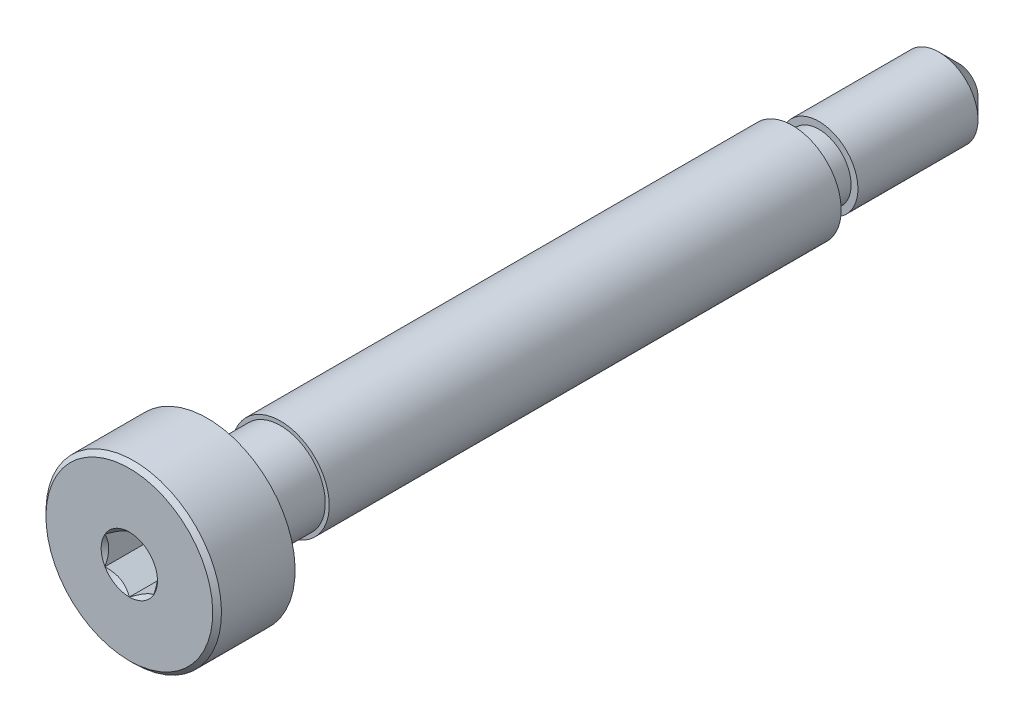
ISO-10303-21;
HEADER;
FILE_DESCRIPTION(('STEP AP214'),'2;1');
FILE_NAME('part.step','',(''),(''),'','','');
FILE_SCHEMA(('AUTOMOTIVE_DESIGN { 1 0 10303 214 1 1 1 1 }'));
ENDSEC;
DATA;
#1=APPLICATION_CONTEXT('core data for automotive mechanical design processes');
#2=APPLICATION_PROTOCOL_DEFINITION('international standard','automotive_design',2000,#1);
#3=PRODUCT_CONTEXT('',#1,'mechanical');
#4=PRODUCT('Part','Part','',(#3));
#5=PRODUCT_RELATED_PRODUCT_CATEGORY('part','',(#4));
#6=PRODUCT_DEFINITION_FORMATION('','',#4);
#7=PRODUCT_DEFINITION_CONTEXT('part definition',#1,'design');
#8=PRODUCT_DEFINITION('design','',#6,#7);
#9=PRODUCT_DEFINITION_SHAPE('','',#8);
#10=(LENGTH_UNIT() NAMED_UNIT(*) SI_UNIT(.MILLI.,.METRE.));
#11=(NAMED_UNIT(*) PLANE_ANGLE_UNIT() SI_UNIT($,.RADIAN.));
#12=(NAMED_UNIT(*) SI_UNIT($,.STERADIAN.) SOLID_ANGLE_UNIT());
#13=UNCERTAINTY_MEASURE_WITH_UNIT(LENGTH_MEASURE(1.E-05),#10,'distance_accuracy_value','');
#14=(GEOMETRIC_REPRESENTATION_CONTEXT(3) GLOBAL_UNCERTAINTY_ASSIGNED_CONTEXT((#13)) GLOBAL_UNIT_ASSIGNED_CONTEXT((#10,
#11,#12)) REPRESENTATION_CONTEXT('',''));
#15=CARTESIAN_POINT('',(0.,0.,0.));
#16=DIRECTION('',(0.,0.,1.));
#17=DIRECTION('',(1.,0.,0.));
#18=AXIS2_PLACEMENT_3D('',#15,#16,#17);
#19=CARTESIAN_POINT('',(0.,0.,21.267));
#20=DIRECTION('',(0.,0.,1.));
#21=DIRECTION('',(0.,-1.,0.));
#22=AXIS2_PLACEMENT_3D('',#19,#20,#21);
#23=CYLINDRICAL_SURFACE('',#22,4.5);
#24=CARTESIAN_POINT('',(0.,0.,17.267));
#25=DIRECTION('',(0.,0.,1.));
#26=DIRECTION('',(0.,-1.,0.));
#27=AXIS2_PLACEMENT_3D('',#24,#25,#26);
#28=CIRCLE('',#27,4.5);
#29=CARTESIAN_POINT('',(0.,-4.5,17.267));
#30=VERTEX_POINT('',#29);
#31=EDGE_CURVE('E195',#30,#30,#28,.T.);
#32=ORIENTED_EDGE('',*,*,#31,.T.);
#33=EDGE_LOOP('',(#32));
#34=FACE_BOUND('',#33,.T.);
#35=CARTESIAN_POINT('',(0.,0.,21.042));
#36=DIRECTION('',(0.,0.,1.));
#37=DIRECTION('',(0.,-1.,0.));
#38=AXIS2_PLACEMENT_3D('',#35,#36,#37);
#39=CIRCLE('',#38,4.5);
#40=CARTESIAN_POINT('',(0.,-4.49999999999999,21.042));
#41=VERTEX_POINT('',#40);
#42=EDGE_CURVE('E455',#41,#41,#39,.T.);
#43=ORIENTED_EDGE('',*,*,#42,.F.);
#44=EDGE_LOOP('',(#43));
#45=FACE_BOUND('',#44,.T.);
#46=ADVANCED_FACE('F49',(#34,#45),#23,.T.);
#47=CARTESIAN_POINT('',(0.,2.5,-12.733));
#48=DIRECTION('',(0.,0.,1.));
#49=DIRECTION('',(0.,-1.,0.));
#50=AXIS2_PLACEMENT_3D('',#47,#48,#49);
#51=PLANE('',#50);
#52=CARTESIAN_POINT('',(0.,0.,-12.733));
#53=DIRECTION('',(0.,0.,1.));
#54=DIRECTION('',(0.,-1.,0.));
#55=AXIS2_PLACEMENT_3D('',#52,#53,#54);
#56=CIRCLE('',#55,1.825397);
#57=CARTESIAN_POINT('',(0.,-1.825397,-12.733));
#58=VERTEX_POINT('',#57);
#59=EDGE_CURVE('E159',#58,#58,#56,.T.);
#60=ORIENTED_EDGE('',*,*,#59,.T.);
#61=EDGE_LOOP('',(#60));
#62=FACE_BOUND('',#61,.T.);
#63=CARTESIAN_POINT('',(0.,0.,-12.733));
#64=DIRECTION('',(0.,0.,1.));
#65=DIRECTION('',(0.,-1.,0.));
#66=AXIS2_PLACEMENT_3D('',#63,#64,#65);
#67=CIRCLE('',#66,2.);
#68=CARTESIAN_POINT('',(0.,-2.,-12.733));
#69=VERTEX_POINT('',#68);
#70=EDGE_CURVE('E186',#69,#69,#67,.T.);
#71=ORIENTED_EDGE('',*,*,#70,.F.);
#72=EDGE_LOOP('',(#71));
#73=FACE_BOUND('',#72,.T.);
#74=ADVANCED_FACE('F285',(#62,#73),#51,.F.);
#75=CARTESIAN_POINT('',(0.,2.,-21.267));
#76=DIRECTION('',(0.,0.,1.));
#77=DIRECTION('',(0.,-1.,0.));
#78=AXIS2_PLACEMENT_3D('',#75,#76,#77);
#79=PLANE('',#78);
#80=CARTESIAN_POINT('',(0.,0.,-21.267));
#81=DIRECTION('',(0.,0.,1.));
#82=DIRECTION('',(0.,-1.,0.));
#83=AXIS2_PLACEMENT_3D('',#80,#81,#82);
#84=CIRCLE('',#83,0.981738054499988);
#85=CARTESIAN_POINT('',(0.,-0.981738054499988,-21.267));
#86=VERTEX_POINT('',#85);
#87=EDGE_CURVE('E12',#86,#86,#84,.F.);
#88=ORIENTED_EDGE('',*,*,#87,.T.);
#89=EDGE_LOOP('',(#88));
#90=FACE_BOUND('',#89,.T.);
#91=ADVANCED_FACE('F293',(#90),#79,.F.);
#92=CARTESIAN_POINT('',(0.,0.,21.267));
#93=DIRECTION('',(0.,0.,1.));
#94=DIRECTION('',(0.,-1.,0.));
#95=AXIS2_PLACEMENT_3D('',#92,#93,#94);
#96=CYLINDRICAL_SURFACE('',#95,2.);
#97=CARTESIAN_POINT('',(0.,0.,-20.2487380545));
#98=DIRECTION('',(0.,0.,1.));
#99=DIRECTION('',(0.,-1.,0.));
#100=AXIS2_PLACEMENT_3D('',#97,#98,#99);
#101=CIRCLE('',#100,2.);
#102=CARTESIAN_POINT('',(0.,-2.,-20.2487380545));
#103=VERTEX_POINT('',#102);
#104=EDGE_CURVE('E58',#103,#103,#101,.T.);
#105=ORIENTED_EDGE('',*,*,#104,.T.);
#106=EDGE_LOOP('',(#105));
#107=FACE_BOUND('',#106,.T.);
#108=CARTESIAN_POINT('',(0.,0.,-14.090682594));
#109=DIRECTION('',(0.,0.,1.));
#110=DIRECTION('',(0.,-1.,0.));
#111=AXIS2_PLACEMENT_3D('',#108,#109,#110);
#112=CIRCLE('',#111,2.);
#113=CARTESIAN_POINT('',(0.,-2.,-14.090682594));
#114=VERTEX_POINT('',#113);
#115=EDGE_CURVE('E174',#114,#114,#112,.T.);
#116=ORIENTED_EDGE('',*,*,#115,.F.);
#117=EDGE_LOOP('',(#116));
#118=FACE_BOUND('',#117,.T.);
#119=ADVANCED_FACE('F489',(#107,#118),#96,.T.);
#120=CARTESIAN_POINT('',(0.,1.650794,-14.090682594));
#121=DIRECTION('',(0.,0.,-1.));
#122=DIRECTION('',(0.,1.,0.));
#123=AXIS2_PLACEMENT_3D('',#120,#121,#122);
#124=PLANE('',#123);
#125=CARTESIAN_POINT('',(0.,0.,-14.090682594));
#126=DIRECTION('',(0.,0.,1.));
#127=DIRECTION('',(0.,-1.,0.));
#128=AXIS2_PLACEMENT_3D('',#125,#126,#127);
#129=CIRCLE('',#128,1.650794);
#130=CARTESIAN_POINT('',(0.,-1.650794,-14.090682594));
#131=VERTEX_POINT('',#130);
#132=EDGE_CURVE('E178',#131,#131,#129,.T.);
#133=ORIENTED_EDGE('',*,*,#132,.F.);
#134=EDGE_LOOP('',(#133));
#135=FACE_BOUND('',#134,.T.);
#136=ORIENTED_EDGE('',*,*,#115,.T.);
#137=EDGE_LOOP('',(#136));
#138=FACE_BOUND('',#137,.T.);
#139=ADVANCED_FACE('F332',(#135,#138),#124,.F.);
#140=CARTESIAN_POINT('',(0.,0.,21.267));
#141=DIRECTION('',(0.,0.,1.));
#142=DIRECTION('',(0.,-1.,0.));
#143=AXIS2_PLACEMENT_3D('',#140,#141,#142);
#144=CYLINDRICAL_SURFACE('',#143,1.650794);
#145=CARTESIAN_POINT('',(0.,0.,-12.907603));
#146=DIRECTION('',(0.,0.,1.));
#147=DIRECTION('',(0.,-1.,0.));
#148=AXIS2_PLACEMENT_3D('',#145,#146,#147);
#149=CIRCLE('',#148,1.650794);
#150=CARTESIAN_POINT('',(0.,-1.650794,-12.907603));
#151=VERTEX_POINT('',#150);
#152=EDGE_CURVE('E182',#151,#151,#149,.T.);
#153=ORIENTED_EDGE('',*,*,#152,.F.);
#154=EDGE_LOOP('',(#153));
#155=FACE_BOUND('',#154,.T.);
#156=ORIENTED_EDGE('',*,*,#132,.T.);
#157=EDGE_LOOP('',(#156));
#158=FACE_BOUND('',#157,.T.);
#159=ADVANCED_FACE('F319',(#155,#158),#144,.T.);
#160=CARTESIAN_POINT('',(0.,0.,-12.907603));
#161=DIRECTION('',(0.,0.,1.));
#162=DIRECTION('',(0.,-1.,0.));
#163=AXIS2_PLACEMENT_3D('',#160,#161,#162);
#164=TOROIDAL_SURFACE('',#163,1.825397,0.174603000000002);
#165=ORIENTED_EDGE('',*,*,#59,.F.);
#166=EDGE_LOOP('',(#165));
#167=FACE_BOUND('',#166,.T.);
#168=ORIENTED_EDGE('',*,*,#152,.T.);
#169=EDGE_LOOP('',(#168));
#170=FACE_BOUND('',#169,.T.);
#171=ADVANCED_FACE('F314',(#167,#170),#164,.F.);
#172=CARTESIAN_POINT('',(0.,0.,-12.733));
#173=DIRECTION('',(0.,0.,-1.));
#174=DIRECTION('',(0.,1.,0.));
#175=AXIS2_PLACEMENT_3D('',#172,#173,#174);
#176=CONICAL_SURFACE('',#175,2.,1.55948252383563);
#177=CARTESIAN_POINT('',(0.,0.,-12.7325689533032));
#178=DIRECTION('',(0.,0.,1.));
#179=DIRECTION('',(0.,-1.,0.));
#180=AXIS2_PLACEMENT_3D('',#177,#178,#179);
#181=CIRCLE('',#180,1.96190243841471);
#182=CARTESIAN_POINT('',(0.,-1.96190243841471,-12.7325689533032));
#183=VERTEX_POINT('',#182);
#184=EDGE_CURVE('E199',#183,#183,#181,.T.);
#185=ORIENTED_EDGE('',*,*,#184,.F.);
#186=EDGE_LOOP('',(#185));
#187=FACE_BOUND('',#186,.T.);
#188=ORIENTED_EDGE('',*,*,#70,.T.);
#189=EDGE_LOOP('',(#188));
#190=FACE_BOUND('',#189,.T.);
#191=ADVANCED_FACE('F311',(#187,#190),#176,.T.);
#192=CARTESIAN_POINT('',(0.,0.,13.5174310466968));
#193=DIRECTION('',(0.,0.,-1.));
#194=DIRECTION('',(0.,1.,0.));
#195=AXIS2_PLACEMENT_3D('',#192,#193,#194);
#196=CONICAL_SURFACE('',#195,2.25890243841471,1.55948252383563);
#197=CARTESIAN_POINT('',(0.,0.,13.517));
#198=DIRECTION('',(0.,0.,1.));
#199=DIRECTION('',(0.,-1.,0.));
#200=AXIS2_PLACEMENT_3D('',#197,#198,#199);
#201=CIRCLE('',#200,2.297);
#202=CARTESIAN_POINT('',(0.,-2.297,13.517));
#203=VERTEX_POINT('',#202);
#204=EDGE_CURVE('E194',#203,#203,#201,.T.);
#205=ORIENTED_EDGE('',*,*,#204,.F.);
#206=EDGE_LOOP('',(#205));
#207=FACE_BOUND('',#206,.T.);
#208=CARTESIAN_POINT('',(0.,0.,13.5174310466968));
#209=DIRECTION('',(0.,0.,1.));
#210=DIRECTION('',(0.,-1.,0.));
#211=AXIS2_PLACEMENT_3D('',#208,#209,#210);
#212=CIRCLE('',#211,2.25890243841471);
#213=CARTESIAN_POINT('',(0.,-2.25890243841471,13.5174310466968));
#214=VERTEX_POINT('',#213);
#215=EDGE_CURVE('E200',#214,#214,#212,.T.);
#216=ORIENTED_EDGE('',*,*,#215,.T.);
#217=EDGE_LOOP('',(#216));
#218=FACE_BOUND('',#217,.T.);
#219=ADVANCED_FACE('F307',(#207,#218),#196,.F.);
#220=CARTESIAN_POINT('',(0.,0.,13.5174310466968));
#221=DIRECTION('',(0.,0.,1.));
#222=DIRECTION('',(0.,-1.,0.));
#223=AXIS2_PLACEMENT_3D('',#220,#221,#222);
#224=CONICAL_SURFACE('',#223,2.25890243841471,0.011313802959248);
#225=ORIENTED_EDGE('',*,*,#184,.T.);
#226=EDGE_LOOP('',(#225));
#227=FACE_BOUND('',#226,.T.);
#228=ORIENTED_EDGE('',*,*,#215,.F.);
#229=EDGE_LOOP('',(#228));
#230=FACE_BOUND('',#229,.T.);
#231=ADVANCED_FACE('F304',(#227,#230),#224,.T.);
#232=CARTESIAN_POINT('',(0.,4.5,17.267));
#233=DIRECTION('',(0.,0.,1.));
#234=DIRECTION('',(0.,-1.,0.));
#235=AXIS2_PLACEMENT_3D('',#232,#233,#234);
#236=PLANE('',#235);
#237=ORIENTED_EDGE('',*,*,#31,.F.);
#238=EDGE_LOOP('',(#237));
#239=FACE_BOUND('',#238,.T.);
#240=CARTESIAN_POINT('',(0.,0.,17.267));
#241=DIRECTION('',(0.,0.,1.));
#242=DIRECTION('',(0.,-1.,0.));
#243=AXIS2_PLACEMENT_3D('',#240,#241,#242);
#244=CIRCLE('',#243,2.297);
#245=CARTESIAN_POINT('',(0.,-2.297,17.267));
#246=VERTEX_POINT('',#245);
#247=EDGE_CURVE('E190',#246,#246,#244,.T.);
#248=ORIENTED_EDGE('',*,*,#247,.T.);
#249=EDGE_LOOP('',(#248));
#250=FACE_BOUND('',#249,.T.);
#251=ADVANCED_FACE('F298',(#239,#250),#236,.F.);
#252=CARTESIAN_POINT('',(0.,0.,21.267));
#253=DIRECTION('',(0.,0.,1.));
#254=DIRECTION('',(0.,-1.,0.));
#255=AXIS2_PLACEMENT_3D('',#252,#253,#254);
#256=CYLINDRICAL_SURFACE('',#255,2.297);
#257=ORIENTED_EDGE('',*,*,#247,.F.);
#258=EDGE_LOOP('',(#257));
#259=FACE_BOUND('',#258,.T.);
#260=ORIENTED_EDGE('',*,*,#204,.T.);
#261=EDGE_LOOP('',(#260));
#262=FACE_BOUND('',#261,.T.);
#263=ADVANCED_FACE('F338',(#259,#262),#256,.T.);
#264=CARTESIAN_POINT('',(0.,0.,-20.2487380545));
#265=DIRECTION('',(0.,0.,1.));
#266=DIRECTION('',(0.,-1.,0.));
#267=AXIS2_PLACEMENT_3D('',#264,#265,#266);
#268=CONICAL_SURFACE('',#267,2.,0.785398163397454);
#269=ORIENTED_EDGE('',*,*,#87,.F.);
#270=EDGE_LOOP('',(#269));
#271=FACE_BOUND('',#270,.T.);
#272=ORIENTED_EDGE('',*,*,#104,.F.);
#273=EDGE_LOOP('',(#272));
#274=FACE_BOUND('',#273,.T.);
#275=ADVANCED_FACE('F51',(#271,#274),#268,.T.);
#276=CARTESIAN_POINT('',(0.,0.,21.267));
#277=DIRECTION('',(0.,0.,-1.));
#278=DIRECTION('',(0.,1.,0.));
#279=AXIS2_PLACEMENT_3D('',#276,#277,#278);
#280=CONICAL_SURFACE('',#279,4.275,0.78539816339745);
#281=ORIENTED_EDGE('',*,*,#42,.T.);
#282=EDGE_LOOP('',(#281));
#283=FACE_BOUND('',#282,.T.);
#284=CARTESIAN_POINT('',(0.,0.,21.267));
#285=DIRECTION('',(0.,0.,1.));
#286=DIRECTION('',(0.,-1.,0.));
#287=AXIS2_PLACEMENT_3D('',#284,#285,#286);
#288=CIRCLE('',#287,4.275);
#289=CARTESIAN_POINT('',(0.,-4.27499999999999,21.267));
#290=VERTEX_POINT('',#289);
#291=EDGE_CURVE('E458',#290,#290,#288,.T.);
#292=ORIENTED_EDGE('',*,*,#291,.F.);
#293=EDGE_LOOP('',(#292));
#294=FACE_BOUND('',#293,.T.);
#295=ADVANCED_FACE('F230',(#283,#294),#280,.T.);
#296=CARTESIAN_POINT('',(0.,0.,19.267));
#297=DIRECTION('',(0.,0.,1.));
#298=DIRECTION('',(1.,0.,0.));
#299=AXIS2_PLACEMENT_3D('',#296,#297,#298);
#300=PLANE('',#299);
#301=DIRECTION('',(-0.866025403784439,0.499999999999999,0.));
#302=VECTOR('',#301,1.);
#303=CARTESIAN_POINT('',(1.25,0.721687836487033,19.267));
#304=LINE('',#303,#302);
#305=CARTESIAN_POINT('',(1.25,0.721687836487033,19.267));
#306=VERTEX_POINT('',#305);
#307=CARTESIAN_POINT('',(0.,1.44337567297406,19.267));
#308=VERTEX_POINT('',#307);
#309=EDGE_CURVE('E109',#306,#308,#304,.T.);
#310=ORIENTED_EDGE('',*,*,#309,.T.);
#311=DIRECTION('',(-0.866025403784438,-0.5,0.));
#312=VECTOR('',#311,1.);
#313=CARTESIAN_POINT('',(0.,1.44337567297406,19.267));
#314=LINE('',#313,#312);
#315=CARTESIAN_POINT('',(-1.25,0.721687836487032,19.267));
#316=VERTEX_POINT('',#315);
#317=EDGE_CURVE('E120',#308,#316,#314,.T.);
#318=ORIENTED_EDGE('',*,*,#317,.T.);
#319=DIRECTION('',(0.,-1.,0.));
#320=VECTOR('',#319,1.);
#321=CARTESIAN_POINT('',(-1.25,0.721687836487032,19.267));
#322=LINE('',#321,#320);
#323=CARTESIAN_POINT('',(-1.25,-0.721687836487032,19.267));
#324=VERTEX_POINT('',#323);
#325=EDGE_CURVE('E127',#316,#324,#322,.T.);
#326=ORIENTED_EDGE('',*,*,#325,.T.);
#327=DIRECTION('',(0.866025403784439,-0.499999999999999,0.));
#328=VECTOR('',#327,1.);
#329=CARTESIAN_POINT('',(-1.25,-0.721687836487032,19.267));
#330=LINE('',#329,#328);
#331=CARTESIAN_POINT('',(0.,-1.44337567297406,19.267));
#332=VERTEX_POINT('',#331);
#333=EDGE_CURVE('E147',#324,#332,#330,.T.);
#334=ORIENTED_EDGE('',*,*,#333,.T.);
#335=DIRECTION('',(0.866025403784438,0.5,0.));
#336=VECTOR('',#335,1.);
#337=CARTESIAN_POINT('',(0.,-1.44337567297406,19.267));
#338=LINE('',#337,#336);
#339=CARTESIAN_POINT('',(1.25,-0.721687836487031,19.267));
#340=VERTEX_POINT('',#339);
#341=EDGE_CURVE('E151',#332,#340,#338,.T.);
#342=ORIENTED_EDGE('',*,*,#341,.T.);
#343=DIRECTION('',(0.,1.,0.));
#344=VECTOR('',#343,1.);
#345=CARTESIAN_POINT('',(1.25,-0.721687836487031,19.267));
#346=LINE('',#345,#344);
#347=EDGE_CURVE('E117',#340,#306,#346,.T.);
#348=ORIENTED_EDGE('',*,*,#347,.T.);
#349=EDGE_LOOP('',(#310,#318,#326,#334,#342,#348));
#350=FACE_BOUND('',#349,.T.);
#351=ADVANCED_FACE('F129',(#350),#300,.T.);
#352=CARTESIAN_POINT('',(-1.25,0.721687836487032,19.267));
#353=DIRECTION('',(-1.,0.,0.));
#354=DIRECTION('',(0.,-1.,0.));
#355=AXIS2_PLACEMENT_3D('',#352,#353,#354);
#356=PLANE('',#355);
#357=DIRECTION('',(0.,0.,1.));
#358=VECTOR('',#357,1.);
#359=CARTESIAN_POINT('',(-1.25,0.721687836487032,19.267));
#360=LINE('',#359,#358);
#361=CARTESIAN_POINT('',(-1.25,0.721687836487033,21.267));
#362=VERTEX_POINT('',#361);
#363=EDGE_CURVE('E116',#316,#362,#360,.T.);
#364=ORIENTED_EDGE('',*,*,#363,.T.);
#365=CARTESIAN_POINT('',(-1.25,-1.43934010808077,21.7299820968923));
#366=CARTESIAN_POINT('',(-1.25,-1.40429313005659,21.7035249226329));
#367=CARTESIAN_POINT('',(-1.25,-1.36905087135599,21.6773271603543));
#368=CARTESIAN_POINT('',(-1.25,-1.29809650706311,21.6255575718396));
#369=CARTESIAN_POINT('',(-1.25,-1.26238428576496,21.5999859043563));
#370=CARTESIAN_POINT('',(-1.25,-1.15390111792708,21.5240059936895));
#371=CARTESIAN_POINT('',(-1.25,-1.08031646726264,21.4747402861896));
#372=CARTESIAN_POINT('',(-1.25,-0.926012322755095,21.3780258302631));
#373=CARTESIAN_POINT('',(-1.25,-0.845125318656146,21.3308412989418));
#374=CARTESIAN_POINT('',(-1.25,-0.679311174076602,21.2445307343904));
#375=CARTESIAN_POINT('',(-1.25,-0.594398891026688,21.2053775346269));
#376=CARTESIAN_POINT('',(-1.25,-0.466944812460741,21.1574772236883));
#377=CARTESIAN_POINT('',(-1.25,-0.426289985812822,21.1437294897863));
#378=CARTESIAN_POINT('',(-1.25,-0.343998850091268,21.1194979274505));
#379=CARTESIAN_POINT('',(-1.25,-0.302362473614963,21.1090143238698));
#380=CARTESIAN_POINT('',(-1.25,-0.219052696285666,21.0920301617483));
#381=CARTESIAN_POINT('',(-1.25,-0.1773934284745,21.0854613604714));
#382=CARTESIAN_POINT('',(-1.25,-0.0936293693401927,21.0764350534578));
#383=CARTESIAN_POINT('',(-1.25,-0.0515246558543966,21.0739768409973));
#384=CARTESIAN_POINT('',(-1.25,0.0311890576306311,21.0733540620133));
#385=CARTESIAN_POINT('',(-1.25,0.0717969625499301,21.0750371168463));
#386=CARTESIAN_POINT('',(-1.25,0.152668636885197,21.0822682705979));
#387=CARTESIAN_POINT('',(-1.25,0.192932338835358,21.0878171104131));
#388=CARTESIAN_POINT('',(-1.25,0.273499879165295,21.102571036465));
#389=CARTESIAN_POINT('',(-1.25,0.313792180618511,21.1118381759641));
#390=CARTESIAN_POINT('',(-1.25,0.393496413911457,21.1335361784573));
#391=CARTESIAN_POINT('',(-1.25,0.432908419115058,21.1459667767306));
#392=CARTESIAN_POINT('',(-1.25,0.556992735862297,21.1897793529314));
#393=CARTESIAN_POINT('',(-1.25,0.639898924666084,21.226151072876));
#394=CARTESIAN_POINT('',(-1.25,0.8018165554997,21.3070191621783));
#395=CARTESIAN_POINT('',(-1.25,0.880812666325044,21.351544720912));
#396=CARTESIAN_POINT('',(-1.25,1.0317856127975,21.4434048766666));
#397=CARTESIAN_POINT('',(-1.25,1.10391618485086,21.4904899339163));
#398=CARTESIAN_POINT('',(-1.25,1.2101860604331,21.5632785615985));
#399=CARTESIAN_POINT('',(-1.25,1.24515069969379,21.5877980853934));
#400=CARTESIAN_POINT('',(-1.25,1.31460220852736,21.6374856367657));
#401=CARTESIAN_POINT('',(-1.25,1.34908920596618,21.6626534854155));
#402=CARTESIAN_POINT('',(-1.25,1.38337731682912,21.6880901488412));
#403=B_SPLINE_CURVE_WITH_KNOTS('',3,(#365,#366,#367,#368,#369,#370,#371,#372,#373,#374,#375,
#376,#377,#378,#379,#380,#381,#382,#383,#384,#385,#386,#387,#388,#389,#390,#391,#392,#393,#394,
#395,#396,#397,#398,#399,#400,#401,#402),.UNSPECIFIED.,.F.,.F.,(4,2,2,2,2,2,2,2,2,2,2,2,2,2,2,2,
2,2,4),(0.,0.131732960381448,0.263498984161644,0.529042014455828,0.809741926134622,
1.08947609717225,1.21811634272577,1.34676544783901,1.47310084517844,1.59941451973785,
1.7211504216785,1.84290966131735,1.96679153905342,2.09066305366039,2.36146692896009,
2.63325989198491,2.89154668212279,3.01965734507713,3.14773302245628),.UNSPECIFIED.);
#404=CARTESIAN_POINT('',(-1.25,-0.721687836487033,21.267));
#405=VERTEX_POINT('',#404);
#406=EDGE_CURVE('E237',#362,#405,#403,.F.);
#407=ORIENTED_EDGE('',*,*,#406,.T.);
#408=DIRECTION('',(0.,0.,1.));
#409=VECTOR('',#408,1.);
#410=CARTESIAN_POINT('',(-1.25,-0.721687836487032,19.267));
#411=LINE('',#410,#409);
#412=EDGE_CURVE('E168',#324,#405,#411,.T.);
#413=ORIENTED_EDGE('',*,*,#412,.F.);
#414=ORIENTED_EDGE('',*,*,#325,.F.);
#415=EDGE_LOOP('',(#364,#407,#413,#414));
#416=FACE_BOUND('',#415,.T.);
#417=ADVANCED_FACE('F275',(#416),#356,.F.);
#418=CARTESIAN_POINT('',(-1.25,-0.721687836487032,19.267));
#419=DIRECTION('',(-0.499999999999999,-0.866025403784439,0.));
#420=DIRECTION('',(0.866025403784439,-0.499999999999999,0.));
#421=AXIS2_PLACEMENT_3D('',#418,#419,#420);
#422=PLANE('',#421);
#423=ORIENTED_EDGE('',*,*,#412,.T.);
#424=CARTESIAN_POINT('',(-1.2502,-0.721572366433194,21.2671154839091));
#425=CARTESIAN_POINT('',(-1.20722483292841,-0.746384090710444,21.2423216680551));
#426=CARTESIAN_POINT('',(-1.16353099525405,-0.771610739653664,21.2189837344187));
#427=CARTESIAN_POINT('',(-1.07443406915806,-0.823050873919154,21.1762520040845));
#428=CARTESIAN_POINT('',(-1.02902250164294,-0.849269254648332,21.1568819923604));
#429=CARTESIAN_POINT('',(-0.937452179064742,-0.902137405038634,21.1237004834135));
#430=CARTESIAN_POINT('',(-0.891316759824116,-0.928773701756386,21.1098055590527));
#431=CARTESIAN_POINT('',(-0.798029919592409,-0.982632884076012,21.0883972821606));
#432=CARTESIAN_POINT('',(-0.750881350863621,-1.00985412292348,21.0808679415668));
#433=CARTESIAN_POINT('',(-0.669626443112748,-1.05676666578643,21.0740744980507));
#434=CARTESIAN_POINT('',(-0.635625123372059,-1.07639733689152,21.0730685591043));
#435=CARTESIAN_POINT('',(-0.567682235567523,-1.11562418145499,21.0747614149113));
#436=CARTESIAN_POINT('',(-0.533740682344343,-1.1352203463451,21.0774610272155));
#437=CARTESIAN_POINT('',(-0.466185143542501,-1.1742235548576,21.0864089303164));
#438=CARTESIAN_POINT('',(-0.432571492713226,-1.19363040521232,21.0926605258997));
#439=CARTESIAN_POINT('',(-0.365905361782188,-1.23212011385119,21.1083756814139));
#440=CARTESIAN_POINT('',(-0.332853128969705,-1.2512028293628,21.1178406200875));
#441=CARTESIAN_POINT('',(-0.248200308399736,-1.30007715810653,21.1459313906876));
#442=CARTESIAN_POINT('',(-0.197133507570362,-1.32956058931202,21.1666701574522));
#443=CARTESIAN_POINT('',(-0.0969991458867458,-1.38737318998519,21.2133871346715));
#444=CARTESIAN_POINT('',(-0.0479256884217311,-1.41570576386268,21.2393482959468));
#445=CARTESIAN_POINT('',(0.000199999999999533,-1.4434911430279,21.2671154839091));
#446=B_SPLINE_CURVE_WITH_KNOTS('',3,(#424,#425,#426,#427,#428,#429,#430,#431,#432,#433,#434,
#435,#436,#437,#438,#439,#440,#441,#442,#443,#444,#445),.UNSPECIFIED.,.F.,.F.,(4,2,2,2,2,2,2,2,
2,2,4),(0.,0.166533409618303,0.334037607289761,0.498880396489698,0.663307919240276,
0.780963963458828,0.898645970148454,1.01643764860773,1.1342799317155,1.32148652032141,
1.50809158792574),.UNSPECIFIED.);
#447=CARTESIAN_POINT('',(0.,-1.44337567297407,21.267));
#448=VERTEX_POINT('',#447);
#449=EDGE_CURVE('E245',#405,#448,#446,.T.);
#450=ORIENTED_EDGE('',*,*,#449,.T.);
#451=DIRECTION('',(0.,0.,1.));
#452=VECTOR('',#451,1.);
#453=CARTESIAN_POINT('',(0.,-1.44337567297406,19.267));
#454=LINE('',#453,#452);
#455=EDGE_CURVE('E164',#332,#448,#454,.T.);
#456=ORIENTED_EDGE('',*,*,#455,.F.);
#457=ORIENTED_EDGE('',*,*,#333,.F.);
#458=EDGE_LOOP('',(#423,#450,#456,#457));
#459=FACE_BOUND('',#458,.T.);
#460=ADVANCED_FACE('F271',(#459),#422,.F.);
#461=CARTESIAN_POINT('',(0.,-1.44337567297406,19.267));
#462=DIRECTION('',(0.500000000000001,-0.866025403784438,0.));
#463=DIRECTION('',(0.866025403784438,0.500000000000001,0.));
#464=AXIS2_PLACEMENT_3D('',#461,#462,#463);
#465=PLANE('',#464);
#466=ORIENTED_EDGE('',*,*,#455,.T.);
#467=CARTESIAN_POINT('',(-0.000199999999998576,-1.4434911430279,21.2671154839091));
#468=CARTESIAN_POINT('',(0.0427751670715874,-1.41867941875065,21.2423216680551));
#469=CARTESIAN_POINT('',(0.0864690047459486,-1.39345276980743,21.2189837344187));
#470=CARTESIAN_POINT('',(0.175565930841942,-1.34201263554194,21.1762520040845));
#471=CARTESIAN_POINT('',(0.220977498357064,-1.31579425481276,21.1568819923604));
#472=CARTESIAN_POINT('',(0.31254782093526,-1.26292610442246,21.1237004834135));
#473=CARTESIAN_POINT('',(0.358683240175885,-1.23628980770471,21.1098055590527));
#474=CARTESIAN_POINT('',(0.451970080407591,-1.18243062538508,21.0883972821606));
#475=CARTESIAN_POINT('',(0.499118649136378,-1.15520938653761,21.0808679415668));
#476=CARTESIAN_POINT('',(0.58037355688725,-1.10829684367467,21.0740744980507));
#477=CARTESIAN_POINT('',(0.614374876627939,-1.08866617256958,21.0730685591043));
#478=CARTESIAN_POINT('',(0.682317764432475,-1.04943932800611,21.0747614149113));
#479=CARTESIAN_POINT('',(0.716259317655655,-1.02984316311599,21.0774610272155));
#480=CARTESIAN_POINT('',(0.783814856457497,-0.9908399546035,21.0864089303164));
#481=CARTESIAN_POINT('',(0.817428507286772,-0.971433104248772,21.0926605258997));
#482=CARTESIAN_POINT('',(0.88409463821781,-0.932943395609907,21.1083756814139));
#483=CARTESIAN_POINT('',(0.917146871030292,-0.913860680098302,21.1178406200875));
#484=CARTESIAN_POINT('',(1.00179969160026,-0.864986351354569,21.1459313906876));
#485=CARTESIAN_POINT('',(1.05286649242964,-0.835502920149077,21.1666701574522));
#486=CARTESIAN_POINT('',(1.15300085411325,-0.777690319475909,21.2133871346715));
#487=CARTESIAN_POINT('',(1.20207431157827,-0.749357745598417,21.2393482959468));
#488=CARTESIAN_POINT('',(1.2502,-0.721572366433195,21.2671154839091));
#489=B_SPLINE_CURVE_WITH_KNOTS('',3,(#467,#468,#469,#470,#471,#472,#473,#474,#475,#476,#477,
#478,#479,#480,#481,#482,#483,#484,#485,#486,#487,#488),.UNSPECIFIED.,.F.,.F.,(4,2,2,2,2,2,2,2,
2,2,4),(0.,0.166533409618303,0.33403760728976,0.498880396489695,0.66330791924027,
0.780963963458822,0.898645970148448,1.01643764860773,1.13427993171549,1.3214865203214,
1.50809158792573),.UNSPECIFIED.);
#490=CARTESIAN_POINT('',(1.25,-0.72168783648703,21.267));
#491=VERTEX_POINT('',#490);
#492=EDGE_CURVE('E252',#448,#491,#489,.T.);
#493=ORIENTED_EDGE('',*,*,#492,.T.);
#494=DIRECTION('',(0.,0.,1.));
#495=VECTOR('',#494,1.);
#496=CARTESIAN_POINT('',(1.25,-0.721687836487031,19.267));
#497=LINE('',#496,#495);
#498=EDGE_CURVE('E160',#340,#491,#497,.T.);
#499=ORIENTED_EDGE('',*,*,#498,.F.);
#500=ORIENTED_EDGE('',*,*,#341,.F.);
#501=EDGE_LOOP('',(#466,#493,#499,#500));
#502=FACE_BOUND('',#501,.T.);
#503=ADVANCED_FACE('F267',(#502),#465,.F.);
#504=CARTESIAN_POINT('',(1.25,-0.721687836487031,19.267));
#505=DIRECTION('',(1.,0.,0.));
#506=DIRECTION('',(0.,1.,0.));
#507=AXIS2_PLACEMENT_3D('',#504,#505,#506);
#508=PLANE('',#507);
#509=ORIENTED_EDGE('',*,*,#498,.T.);
#510=CARTESIAN_POINT('',(1.25,-1.43934010829018,21.7299820970504));
#511=CARTESIAN_POINT('',(1.25,-1.40429313026012,21.7035249227849));
#512=CARTESIAN_POINT('',(1.25,-1.36905087155364,21.6773271605002));
#513=CARTESIAN_POINT('',(1.25,-1.29809650724891,21.6255575719734));
#514=CARTESIAN_POINT('',(1.25,-1.2623842859448,21.5999859044841));
#515=CARTESIAN_POINT('',(1.25,-1.1539011180887,21.524005993799));
#516=CARTESIAN_POINT('',(1.25,-1.08031646741187,21.474740286287));
#517=CARTESIAN_POINT('',(1.25,-0.926012322877301,21.3780258303356));
#518=CARTESIAN_POINT('',(1.25,-0.845125318763648,21.3308412990016));
#519=CARTESIAN_POINT('',(1.25,-0.679311174153442,21.2445307344266));
#520=CARTESIAN_POINT('',(1.25,-0.594398891087582,21.2053775346522));
#521=CARTESIAN_POINT('',(1.25,-0.466944812509637,21.1574772237056));
#522=CARTESIAN_POINT('',(1.25,-0.426289985866743,21.1437294898039));
#523=CARTESIAN_POINT('',(1.25,-0.343998850155401,21.1194979274677));
#524=CARTESIAN_POINT('',(1.25,-0.302362473684284,21.1090143238863));
#525=CARTESIAN_POINT('',(1.25,-0.219052696365193,21.0920301617622));
#526=CARTESIAN_POINT('',(1.25,-0.177393428559042,21.0854613604834));
#527=CARTESIAN_POINT('',(1.25,-0.0936293694345961,21.076435053465));
#528=CARTESIAN_POINT('',(1.25,-0.0515246559536469,21.0739768410015));
#529=CARTESIAN_POINT('',(1.25,0.0311890575224405,21.0733540620107));
#530=CARTESIAN_POINT('',(1.25,0.0717969624376335,21.0750371168399));
#531=CARTESIAN_POINT('',(1.25,0.152668636765094,21.0822682705835));
#532=CARTESIAN_POINT('',(1.25,0.192932338711554,21.0878171103943));
#533=CARTESIAN_POINT('',(1.25,0.27349987903419,21.102571036437));
#534=CARTESIAN_POINT('',(1.25,0.313792180483815,21.1118381759314));
#535=CARTESIAN_POINT('',(1.25,0.393496413769926,21.1335361784149));
#536=CARTESIAN_POINT('',(1.25,0.432908418970283,21.1459667766833));
#537=CARTESIAN_POINT('',(1.25,0.556992735685997,21.1897793528609));
#538=CARTESIAN_POINT('',(1.25,0.639898924463084,21.2261510727842));
#539=CARTESIAN_POINT('',(1.25,0.801816555245349,21.3070191620416));
#540=CARTESIAN_POINT('',(1.25,0.880812666046055,21.3515447207516));
#541=CARTESIAN_POINT('',(1.25,1.03178561247421,21.443404876461));
#542=CARTESIAN_POINT('',(1.25,1.10391618450775,21.4904899336892));
#543=CARTESIAN_POINT('',(1.25,1.2101860600607,21.5632785613395));
#544=CARTESIAN_POINT('',(1.25,1.24515069931177,21.5877980851238));
#545=CARTESIAN_POINT('',(1.25,1.31460220812615,21.6374856364749));
#546=CARTESIAN_POINT('',(1.25,1.3490892055554,21.6626534851142));
#547=CARTESIAN_POINT('',(1.25,1.38337731640879,21.6880901485293));
#548=B_SPLINE_CURVE_WITH_KNOTS('',3,(#510,#511,#512,#513,#514,#515,#516,#517,#518,#519,#520,
#521,#522,#523,#524,#525,#526,#527,#528,#529,#530,#531,#532,#533,#534,#535,#536,#537,#538,#539,
#540,#541,#542,#543,#544,#545,#546,#547),.UNSPECIFIED.,.F.,.F.,(4,2,2,2,2,2,2,2,2,2,2,2,2,2,2,2,
2,2,4),(0.,0.131732960406519,0.263498984211796,0.529042014557078,0.809741926293174,
1.08947609738757,1.21811634292655,1.34676544802529,1.47310084535081,1.59941451989631,
1.72115042182423,1.84290966145033,1.96679153917268,2.09066305376595,2.36146692896707,
2.63325989189266,2.89154668194565,3.01965734485811,3.14773302219539),.UNSPECIFIED.);
#549=CARTESIAN_POINT('',(1.25,0.721687836487032,21.267));
#550=VERTEX_POINT('',#549);
#551=EDGE_CURVE('E135',#491,#550,#548,.T.);
#552=ORIENTED_EDGE('',*,*,#551,.T.);
#553=DIRECTION('',(0.,0.,1.));
#554=VECTOR('',#553,1.);
#555=CARTESIAN_POINT('',(1.25,0.721687836487033,19.267));
#556=LINE('',#555,#554);
#557=EDGE_CURVE('E156',#306,#550,#556,.T.);
#558=ORIENTED_EDGE('',*,*,#557,.F.);
#559=ORIENTED_EDGE('',*,*,#347,.F.);
#560=EDGE_LOOP('',(#509,#552,#558,#559));
#561=FACE_BOUND('',#560,.T.);
#562=ADVANCED_FACE('F264',(#561),#508,.F.);
#563=CARTESIAN_POINT('',(1.25,0.721687836487033,19.267));
#564=DIRECTION('',(0.499999999999999,0.866025403784439,0.));
#565=DIRECTION('',(-0.866025403784439,0.499999999999999,0.));
#566=AXIS2_PLACEMENT_3D('',#563,#564,#565);
#567=PLANE('',#566);
#568=ORIENTED_EDGE('',*,*,#557,.T.);
#569=CARTESIAN_POINT('',(1.2502,0.721572366433195,21.2671154839091));
#570=CARTESIAN_POINT('',(1.20722483292841,0.746384090710445,21.2423216680551));
#571=CARTESIAN_POINT('',(1.16353099525405,0.771610739653665,21.2189837344187));
#572=CARTESIAN_POINT('',(1.07443406915806,0.823050873919156,21.1762520040845));
#573=CARTESIAN_POINT('',(1.02902250164293,0.849269254648334,21.1568819923604));
#574=CARTESIAN_POINT('',(0.937452179064738,0.902137405038637,21.1237004834135));
#575=CARTESIAN_POINT('',(0.891316759824112,0.928773701756389,21.1098055590527));
#576=CARTESIAN_POINT('',(0.798029919592405,0.982632884076014,21.0883972821606));
#577=CARTESIAN_POINT('',(0.750881350863618,1.00985412292348,21.0808679415668));
#578=CARTESIAN_POINT('',(0.669626443112746,1.05676666578643,21.0740744980507));
#579=CARTESIAN_POINT('',(0.635625123372057,1.07639733689152,21.0730685591044));
#580=CARTESIAN_POINT('',(0.56768223556752,1.11562418145499,21.0747614149113));
#581=CARTESIAN_POINT('',(0.53374068234434,1.1352203463451,21.0774610272155));
#582=CARTESIAN_POINT('',(0.466185143542498,1.1742235548576,21.0864089303164));
#583=CARTESIAN_POINT('',(0.432571492713223,1.19363040521233,21.0926605258997));
#584=CARTESIAN_POINT('',(0.365905361782185,1.23212011385119,21.1083756814139));
#585=CARTESIAN_POINT('',(0.332853128969702,1.2512028293628,21.1178406200875));
#586=CARTESIAN_POINT('',(0.248200308399734,1.30007715810653,21.1459313906876));
#587=CARTESIAN_POINT('',(0.19713350757036,1.32956058931202,21.1666701574522));
#588=CARTESIAN_POINT('',(0.0969991458867435,1.38737318998519,21.2133871346715));
#589=CARTESIAN_POINT('',(0.0479256884217291,1.41570576386268,21.2393482959468));
#590=CARTESIAN_POINT('',(-0.00020000000000047,1.4434911430279,21.2671154839091));
#591=B_SPLINE_CURVE_WITH_KNOTS('',3,(#569,#570,#571,#572,#573,#574,#575,#576,#577,#578,#579,
#580,#581,#582,#583,#584,#585,#586,#587,#588,#589,#590),.UNSPECIFIED.,.F.,.F.,(4,2,2,2,2,2,2,2,
2,2,4),(0.,0.166533409618304,0.334037607289764,0.498880396489701,0.663307919240276,
0.780963963458829,0.898645970148455,1.01643764860774,1.1342799317155,1.32148652032141,
1.50809158792574),.UNSPECIFIED.);
#592=CARTESIAN_POINT('',(0.,1.44337567297406,21.267));
#593=VERTEX_POINT('',#592);
#594=EDGE_CURVE('E111',#550,#593,#591,.T.);
#595=ORIENTED_EDGE('',*,*,#594,.T.);
#596=DIRECTION('',(0.,0.,1.));
#597=VECTOR('',#596,1.);
#598=CARTESIAN_POINT('',(0.,1.44337567297406,19.267));
#599=LINE('',#598,#597);
#600=EDGE_CURVE('E104',#308,#593,#599,.T.);
#601=ORIENTED_EDGE('',*,*,#600,.F.);
#602=ORIENTED_EDGE('',*,*,#309,.F.);
#603=EDGE_LOOP('',(#568,#595,#601,#602));
#604=FACE_BOUND('',#603,.T.);
#605=ADVANCED_FACE('F107',(#604),#567,.F.);
#606=CARTESIAN_POINT('',(0.,1.44337567297406,19.267));
#607=DIRECTION('',(-0.5,0.866025403784438,0.));
#608=DIRECTION('',(-0.866025403784438,-0.5,0.));
#609=AXIS2_PLACEMENT_3D('',#606,#607,#608);
#610=PLANE('',#609);
#611=ORIENTED_EDGE('',*,*,#600,.T.);
#612=CARTESIAN_POINT('',(0.0001999999999992,1.4434911430279,21.2671154839091));
#613=CARTESIAN_POINT('',(-0.0427751670715877,1.41867941875065,21.2423216680551));
#614=CARTESIAN_POINT('',(-0.0864690047459491,1.39345276980743,21.2189837344187));
#615=CARTESIAN_POINT('',(-0.175565930841943,1.34201263554194,21.1762520040845));
#616=CARTESIAN_POINT('',(-0.220977498357066,1.31579425481276,21.1568819923604));
#617=CARTESIAN_POINT('',(-0.312547820935262,1.26292610442246,21.1237004834135));
#618=CARTESIAN_POINT('',(-0.358683240175887,1.23628980770471,21.1098055590527));
#619=CARTESIAN_POINT('',(-0.451970080407594,1.18243062538508,21.0883972821606));
#620=CARTESIAN_POINT('',(-0.499118649136381,1.15520938653761,21.0808679415668));
#621=CARTESIAN_POINT('',(-0.580373556887254,1.10829684367467,21.0740744980507));
#622=CARTESIAN_POINT('',(-0.614374876627943,1.08866617256958,21.0730685591044));
#623=CARTESIAN_POINT('',(-0.68231776443248,1.04943932800611,21.0747614149113));
#624=CARTESIAN_POINT('',(-0.71625931765566,1.02984316311599,21.0774610272155));
#625=CARTESIAN_POINT('',(-0.783814856457502,0.990839954603498,21.0864089303164));
#626=CARTESIAN_POINT('',(-0.817428507286777,0.97143310424877,21.0926605258997));
#627=CARTESIAN_POINT('',(-0.884094638217815,0.932943395609904,21.1083756814139));
#628=CARTESIAN_POINT('',(-0.917146871030297,0.913860680098299,21.1178406200875));
#629=CARTESIAN_POINT('',(-1.00179969160027,0.864986351354566,21.1459313906876));
#630=CARTESIAN_POINT('',(-1.05286649242964,0.835502920149075,21.1666701574522));
#631=CARTESIAN_POINT('',(-1.15300085411326,0.777690319475907,21.2133871346715));
#632=CARTESIAN_POINT('',(-1.20207431157827,0.749357745598416,21.2393482959468));
#633=CARTESIAN_POINT('',(-1.2502,0.721572366433194,21.2671154839091));
#634=B_SPLINE_CURVE_WITH_KNOTS('',3,(#612,#613,#614,#615,#616,#617,#618,#619,#620,#621,#622,
#623,#624,#625,#626,#627,#628,#629,#630,#631,#632,#633),.UNSPECIFIED.,.F.,.F.,(4,2,2,2,2,2,2,2,
2,2,4),(0.,0.166533409618304,0.334037607289763,0.4988803964897,0.663307919240276,
0.780963963458829,0.898645970148455,1.01643764860773,1.1342799317155,1.32148652032141,
1.50809158792574),.UNSPECIFIED.);
#635=EDGE_CURVE('E213',#593,#362,#634,.T.);
#636=ORIENTED_EDGE('',*,*,#635,.T.);
#637=ORIENTED_EDGE('',*,*,#363,.F.);
#638=ORIENTED_EDGE('',*,*,#317,.F.);
#639=EDGE_LOOP('',(#611,#636,#637,#638));
#640=FACE_BOUND('',#639,.T.);
#641=ADVANCED_FACE('F121',(#640),#610,.F.);
#642=CARTESIAN_POINT('',(0.,0.,21.267));
#643=DIRECTION('',(0.,0.,1.));
#644=DIRECTION('',(1.,0.,0.));
#645=AXIS2_PLACEMENT_3D('',#642,#643,#644);
#646=CONICAL_SURFACE('',#645,1.44337567297406,0.78539816339745);
#647=CARTESIAN_POINT('',(0.,0.,21.267));
#648=DIRECTION('',(0.,0.,1.));
#649=DIRECTION('',(1.,0.,0.));
#650=AXIS2_PLACEMENT_3D('',#647,#648,#649);
#651=CIRCLE('',#650,1.44337567297406);
#652=EDGE_CURVE('E474',#362,#405,#651,.T.);
#653=ORIENTED_EDGE('',*,*,#652,.T.);
#654=ORIENTED_EDGE('',*,*,#406,.F.);
#655=EDGE_LOOP('',(#653,#654));
#656=FACE_BOUND('',#655,.T.);
#657=ADVANCED_FACE('F391',(#656),#646,.F.);
#658=EDGE_CURVE('E477',#405,#448,#651,.T.);
#659=ORIENTED_EDGE('',*,*,#658,.T.);
#660=ORIENTED_EDGE('',*,*,#449,.F.);
#661=EDGE_LOOP('',(#659,#660));
#662=FACE_BOUND('',#661,.T.);
#663=ADVANCED_FACE('F407',(#662),#646,.F.);
#664=EDGE_CURVE('E71',#448,#491,#651,.T.);
#665=ORIENTED_EDGE('',*,*,#664,.T.);
#666=ORIENTED_EDGE('',*,*,#492,.F.);
#667=EDGE_LOOP('',(#665,#666));
#668=FACE_BOUND('',#667,.T.);
#669=ADVANCED_FACE('F414',(#668),#646,.F.);
#670=EDGE_CURVE('E64',#491,#550,#651,.T.);
#671=ORIENTED_EDGE('',*,*,#670,.T.);
#672=ORIENTED_EDGE('',*,*,#551,.F.);
#673=EDGE_LOOP('',(#671,#672));
#674=FACE_BOUND('',#673,.T.);
#675=ADVANCED_FACE('F228',(#674),#646,.F.);
#676=EDGE_CURVE('E464',#550,#593,#651,.T.);
#677=ORIENTED_EDGE('',*,*,#676,.T.);
#678=ORIENTED_EDGE('',*,*,#594,.F.);
#679=EDGE_LOOP('',(#677,#678));
#680=FACE_BOUND('',#679,.T.);
#681=ADVANCED_FACE('F222',(#680),#646,.F.);
#682=EDGE_CURVE('E467',#593,#362,#651,.T.);
#683=ORIENTED_EDGE('',*,*,#682,.T.);
#684=ORIENTED_EDGE('',*,*,#635,.F.);
#685=EDGE_LOOP('',(#683,#684));
#686=FACE_BOUND('',#685,.T.);
#687=ADVANCED_FACE('F227',(#686),#646,.F.);
#688=CARTESIAN_POINT('',(0.,0.,21.267));
#689=DIRECTION('',(0.,0.,-1.));
#690=DIRECTION('',(0.,1.,0.));
#691=AXIS2_PLACEMENT_3D('',#688,#689,#690);
#692=PLANE('',#691);
#693=ORIENTED_EDGE('',*,*,#682,.F.);
#694=ORIENTED_EDGE('',*,*,#676,.F.);
#695=ORIENTED_EDGE('',*,*,#670,.F.);
#696=ORIENTED_EDGE('',*,*,#664,.F.);
#697=ORIENTED_EDGE('',*,*,#658,.F.);
#698=ORIENTED_EDGE('',*,*,#652,.F.);
#699=EDGE_LOOP('',(#693,#694,#695,#696,#697,#698));
#700=FACE_BOUND('',#699,.T.);
#701=ORIENTED_EDGE('',*,*,#291,.T.);
#702=EDGE_LOOP('',(#701));
#703=FACE_BOUND('',#702,.T.);
#704=ADVANCED_FACE('F300',(#700,#703),#692,.F.);
#705=CLOSED_SHELL('',(#46,#74,#91,#119,#139,#159,#171,#191,#219,#231,#251,#263,#275,#295,#351,
#417,#460,#503,#562,#605,#641,#657,#663,#669,#675,#681,#687,#704));
#706=MANIFOLD_SOLID_BREP('B2',#705);
#707=CARTESIAN_POINT('',(0.,2.5,-12.733));
#708=DIRECTION('',(0.,0.,1.));
#709=DIRECTION('',(0.,-1.,0.));
#710=AXIS2_PLACEMENT_3D('',#707,#708,#709);
#711=PLANE('',#710);
#712=CARTESIAN_POINT('',(0.,0.,-12.733));
#713=DIRECTION('',(0.,0.,1.));
#714=DIRECTION('',(0.,-1.,0.));
#715=AXIS2_PLACEMENT_3D('',#712,#713,#714);
#716=CIRCLE('',#715,2.);
#717=CARTESIAN_POINT('',(0.,-2.,-12.733));
#718=VERTEX_POINT('',#717);
#719=EDGE_CURVE('E48',#718,#718,#716,.T.);
#720=ORIENTED_EDGE('',*,*,#719,.T.);
#721=EDGE_LOOP('',(#720));
#722=FACE_BOUND('',#721,.T.);
#723=CARTESIAN_POINT('',(0.,0.,-12.733));
#724=DIRECTION('',(0.,0.,1.));
#725=DIRECTION('',(0.,-1.,0.));
#726=AXIS2_PLACEMENT_3D('',#723,#724,#725);
#727=CIRCLE('',#726,2.5);
#728=CARTESIAN_POINT('',(0.,-2.5,-12.733));
#729=VERTEX_POINT('',#728);
#730=EDGE_CURVE('E539',#729,#729,#727,.T.);
#731=ORIENTED_EDGE('',*,*,#730,.F.);
#732=EDGE_LOOP('',(#731));
#733=FACE_BOUND('',#732,.T.);
#734=ADVANCED_FACE('F536',(#722,#733),#711,.F.);
#735=CARTESIAN_POINT('',(0.,0.,21.267));
#736=DIRECTION('',(0.,0.,1.));
#737=DIRECTION('',(0.,-1.,0.));
#738=AXIS2_PLACEMENT_3D('',#735,#736,#737);
#739=CYLINDRICAL_SURFACE('',#738,2.5);
#740=CARTESIAN_POINT('',(0.,0.,13.517));
#741=DIRECTION('',(0.,0.,1.));
#742=DIRECTION('',(0.,-1.,0.));
#743=AXIS2_PLACEMENT_3D('',#740,#741,#742);
#744=CIRCLE('',#743,2.5);
#745=CARTESIAN_POINT('',(0.,-2.5,13.517));
#746=VERTEX_POINT('',#745);
#747=EDGE_CURVE('E549',#746,#746,#744,.T.);
#748=ORIENTED_EDGE('',*,*,#747,.F.);
#749=EDGE_LOOP('',(#748));
#750=FACE_BOUND('',#749,.T.);
#751=ORIENTED_EDGE('',*,*,#730,.T.);
#752=EDGE_LOOP('',(#751));
#753=FACE_BOUND('',#752,.T.);
#754=ADVANCED_FACE('F556',(#750,#753),#739,.T.);
#755=CARTESIAN_POINT('',(0.,2.297,13.517));
#756=DIRECTION('',(0.,0.,-1.));
#757=DIRECTION('',(0.,1.,0.));
#758=AXIS2_PLACEMENT_3D('',#755,#756,#757);
#759=PLANE('',#758);
#760=CARTESIAN_POINT('',(0.,0.,13.517));
#761=DIRECTION('',(0.,0.,1.));
#762=DIRECTION('',(0.,-1.,0.));
#763=AXIS2_PLACEMENT_3D('',#760,#761,#762);
#764=CIRCLE('',#763,2.297);
#765=CARTESIAN_POINT('',(0.,-2.297,13.517));
#766=VERTEX_POINT('',#765);
#767=EDGE_CURVE('E543',#766,#766,#764,.T.);
#768=ORIENTED_EDGE('',*,*,#767,.F.);
#769=EDGE_LOOP('',(#768));
#770=FACE_BOUND('',#769,.T.);
#771=ORIENTED_EDGE('',*,*,#747,.T.);
#772=EDGE_LOOP('',(#771));
#773=FACE_BOUND('',#772,.T.);
#774=ADVANCED_FACE('F564',(#770,#773),#759,.F.);
#775=CARTESIAN_POINT('',(0.,0.,13.517));
#776=DIRECTION('',(0.,0.,1.));
#777=DIRECTION('',(0.,-1.,0.));
#778=AXIS2_PLACEMENT_3D('',#775,#776,#777);
#779=CONICAL_SURFACE('',#778,2.297,0.011313802959248);
#780=ORIENTED_EDGE('',*,*,#719,.F.);
#781=EDGE_LOOP('',(#780));
#782=FACE_BOUND('',#781,.T.);
#783=ORIENTED_EDGE('',*,*,#767,.T.);
#784=EDGE_LOOP('',(#783));
#785=FACE_BOUND('',#784,.T.);
#786=ADVANCED_FACE('F568',(#782,#785),#779,.F.);
#787=CLOSED_SHELL('',(#734,#754,#774,#786));
#788=MANIFOLD_SOLID_BREP('B6',#787);
#789=ADVANCED_BREP_SHAPE_REPRESENTATION('',(#18,#706,#788),#14);
#790=SHAPE_DEFINITION_REPRESENTATION(#9,#789);
ENDSEC;
END-ISO-10303-21;
